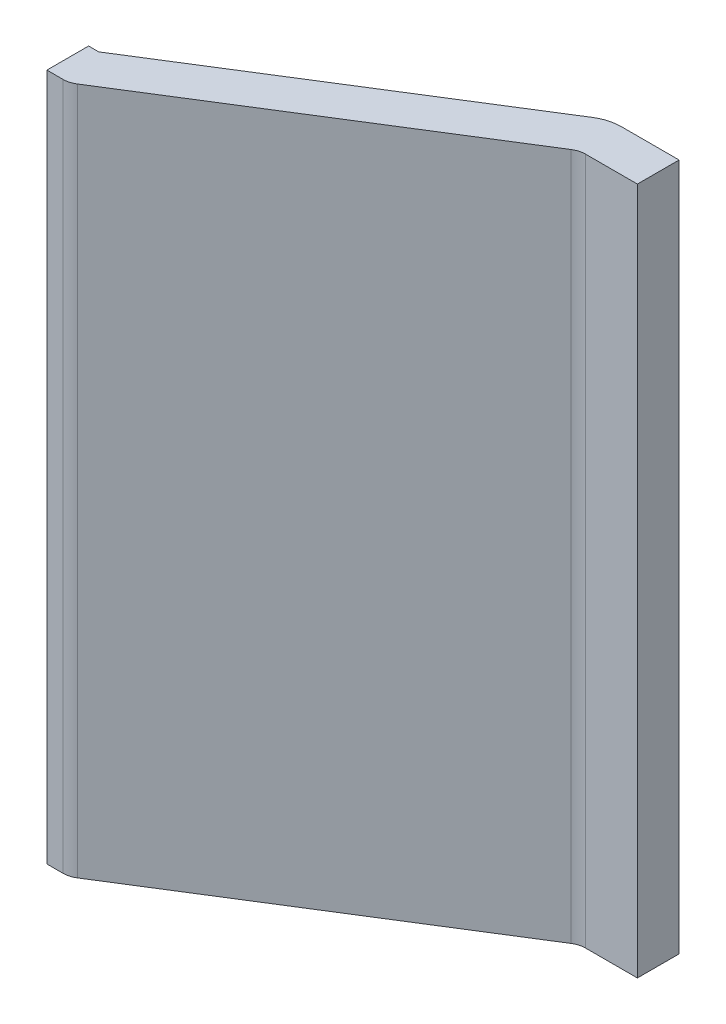
ISO-10303-21;
HEADER;
FILE_DESCRIPTION(('STEP AP214'),'2;1');
FILE_NAME('part.step','',(''),(''),'','','');
FILE_SCHEMA(('AUTOMOTIVE_DESIGN { 1 0 10303 214 1 1 1 1 }'));
ENDSEC;
DATA;
#1=APPLICATION_CONTEXT('core data for automotive mechanical design processes');
#2=APPLICATION_PROTOCOL_DEFINITION('international standard','automotive_design',2000,#1);
#3=PRODUCT_CONTEXT('',#1,'mechanical');
#4=PRODUCT('Part','Part','',(#3));
#5=PRODUCT_RELATED_PRODUCT_CATEGORY('part','',(#4));
#6=PRODUCT_DEFINITION_FORMATION('','',#4);
#7=PRODUCT_DEFINITION_CONTEXT('part definition',#1,'design');
#8=PRODUCT_DEFINITION('design','',#6,#7);
#9=PRODUCT_DEFINITION_SHAPE('','',#8);
#10=(LENGTH_UNIT() NAMED_UNIT(*) SI_UNIT(.MILLI.,.METRE.));
#11=(NAMED_UNIT(*) PLANE_ANGLE_UNIT() SI_UNIT($,.RADIAN.));
#12=(NAMED_UNIT(*) SI_UNIT($,.STERADIAN.) SOLID_ANGLE_UNIT());
#13=UNCERTAINTY_MEASURE_WITH_UNIT(LENGTH_MEASURE(1.E-05),#10,'distance_accuracy_value','');
#14=(GEOMETRIC_REPRESENTATION_CONTEXT(3) GLOBAL_UNCERTAINTY_ASSIGNED_CONTEXT((#13)) GLOBAL_UNIT_ASSIGNED_CONTEXT((#10,
#11,#12)) REPRESENTATION_CONTEXT('',''));
#15=CARTESIAN_POINT('',(0.,0.,0.));
#16=DIRECTION('',(0.,0.,1.));
#17=DIRECTION('',(1.,0.,0.));
#18=AXIS2_PLACEMENT_3D('',#15,#16,#17);
#19=CARTESIAN_POINT('',(1.824104576066,-1.525,0.964303036979));
#20=DIRECTION('',(0.,1.,0.));
#21=DIRECTION('',(0.530661276733133,0.,0.847583983671212));
#22=AXIS2_PLACEMENT_3D('',#19,#20,#21);
#23=CYLINDRICAL_SURFACE('',#22,0.0925);
#24=DIRECTION('',(0.,1.,0.));
#25=VECTOR('',#24,1.);
#26=CARTESIAN_POINT('',(1.873190744164,-1.525,1.042704555469));
#27=LINE('',#26,#25);
#28=CARTESIAN_POINT('',(1.873190744164,-1.525,1.042704555469));
#29=VERTEX_POINT('',#28);
#30=CARTESIAN_POINT('',(1.873190744164,1.525,1.042704555469));
#31=VERTEX_POINT('',#30);
#32=EDGE_CURVE('E26',#29,#31,#27,.T.);
#33=ORIENTED_EDGE('',*,*,#32,.T.);
#34=CARTESIAN_POINT('',(1.824104576066,1.525,0.964303036979));
#35=DIRECTION('',(0.,-1.,0.));
#36=DIRECTION('',(0.,0.,1.));
#37=AXIS2_PLACEMENT_3D('',#34,#35,#36);
#38=CIRCLE('',#37,0.0925);
#39=CARTESIAN_POINT('',(1.824104576066,1.525,1.056803036979));
#40=VERTEX_POINT('',#39);
#41=EDGE_CURVE('E193',#31,#40,#38,.T.);
#42=ORIENTED_EDGE('',*,*,#41,.T.);
#43=DIRECTION('',(0.,1.,0.));
#44=VECTOR('',#43,1.);
#45=CARTESIAN_POINT('',(1.824104576066,-1.525,1.056803036979));
#46=LINE('',#45,#44);
#47=CARTESIAN_POINT('',(1.824104576066,-1.525,1.056803036979));
#48=VERTEX_POINT('',#47);
#49=EDGE_CURVE('E11',#48,#40,#46,.T.);
#50=ORIENTED_EDGE('',*,*,#49,.F.);
#51=CARTESIAN_POINT('',(1.824104576066,-1.525,0.964303036979));
#52=DIRECTION('',(0.,-1.,0.));
#53=DIRECTION('',(0.,0.,1.));
#54=AXIS2_PLACEMENT_3D('',#51,#52,#53);
#55=CIRCLE('',#54,0.0925);
#56=EDGE_CURVE('E138',#29,#48,#55,.T.);
#57=ORIENTED_EDGE('',*,*,#56,.F.);
#58=EDGE_LOOP('',(#33,#42,#50,#57));
#59=FACE_BOUND('',#58,.T.);
#60=ADVANCED_FACE('F17',(#59),#23,.T.);
#61=CARTESIAN_POINT('',(1.7525,-1.525,1.056803036979));
#62=DIRECTION('',(0.,0.,1.));
#63=DIRECTION('',(1.,0.,0.));
#64=AXIS2_PLACEMENT_3D('',#61,#62,#63);
#65=PLANE('',#64);
#66=DIRECTION('',(1.,0.,0.));
#67=VECTOR('',#66,1.);
#68=CARTESIAN_POINT('',(1.7525,1.525,1.056803036979));
#69=LINE('',#68,#67);
#70=CARTESIAN_POINT('',(1.7525,1.525,1.056803036979));
#71=VERTEX_POINT('',#70);
#72=EDGE_CURVE('E189',#71,#40,#69,.T.);
#73=ORIENTED_EDGE('',*,*,#72,.F.);
#74=DIRECTION('',(0.,1.,0.));
#75=VECTOR('',#74,1.);
#76=CARTESIAN_POINT('',(1.7525,-1.525,1.056803036979));
#77=LINE('',#76,#75);
#78=CARTESIAN_POINT('',(1.7525,-1.525,1.056803036979));
#79=VERTEX_POINT('',#78);
#80=EDGE_CURVE('E215',#79,#71,#77,.T.);
#81=ORIENTED_EDGE('',*,*,#80,.F.);
#82=DIRECTION('',(1.,0.,0.));
#83=VECTOR('',#82,1.);
#84=CARTESIAN_POINT('',(1.7525,-1.525,1.056803036979));
#85=LINE('',#84,#83);
#86=EDGE_CURVE('E197',#79,#48,#85,.T.);
#87=ORIENTED_EDGE('',*,*,#86,.T.);
#88=ORIENTED_EDGE('',*,*,#49,.T.);
#89=EDGE_LOOP('',(#73,#81,#87,#88));
#90=FACE_BOUND('',#89,.T.);
#91=ADVANCED_FACE('F252',(#90),#65,.T.);
#92=CARTESIAN_POINT('',(3.288172336196,-1.525,0.156803036979));
#93=DIRECTION('',(0.530661276733133,0.,0.847583983671212));
#94=DIRECTION('',(0.,-1.,0.));
#95=AXIS2_PLACEMENT_3D('',#92,#93,#94);
#96=PLANE('',#95);
#97=DIRECTION('',(-0.847583983671212,0.,0.530661276733133));
#98=VECTOR('',#97,1.);
#99=CARTESIAN_POINT('',(3.288172336196,-1.525,0.156803036979));
#100=LINE('',#99,#98);
#101=CARTESIAN_POINT('',(3.220617112292,-1.525,0.19909848151));
#102=VERTEX_POINT('',#101);
#103=EDGE_CURVE('E128',#102,#29,#100,.T.);
#104=ORIENTED_EDGE('',*,*,#103,.F.);
#105=DIRECTION('',(0.,1.,0.));
#106=VECTOR('',#105,1.);
#107=CARTESIAN_POINT('',(3.220617112292,-1.525,0.19909848151));
#108=LINE('',#107,#106);
#109=CARTESIAN_POINT('',(3.220617112292,1.525,0.19909848151));
#110=VERTEX_POINT('',#109);
#111=EDGE_CURVE('E132',#102,#110,#108,.T.);
#112=ORIENTED_EDGE('',*,*,#111,.T.);
#113=DIRECTION('',(-0.847583983671212,0.,0.530661276733133));
#114=VECTOR('',#113,1.);
#115=CARTESIAN_POINT('',(3.288172336196,1.525,0.156803036979));
#116=LINE('',#115,#114);
#117=EDGE_CURVE('E205',#110,#31,#116,.T.);
#118=ORIENTED_EDGE('',*,*,#117,.T.);
#119=ORIENTED_EDGE('',*,*,#32,.F.);
#120=EDGE_LOOP('',(#104,#112,#118,#119));
#121=FACE_BOUND('',#120,.T.);
#122=ADVANCED_FACE('F19',(#121),#96,.T.);
#123=CARTESIAN_POINT('',(1.7525,-1.525,0.871803036979));
#124=DIRECTION('',(1.,0.,0.));
#125=DIRECTION('',(0.,1.,0.));
#126=AXIS2_PLACEMENT_3D('',#123,#124,#125);
#127=PLANE('',#126);
#128=DIRECTION('',(0.,0.,1.));
#129=VECTOR('',#128,1.);
#130=CARTESIAN_POINT('',(1.7525,-1.525,0.871803036979));
#131=LINE('',#130,#129);
#132=CARTESIAN_POINT('',(1.7525,-1.525,0.871803036979));
#133=VERTEX_POINT('',#132);
#134=EDGE_CURVE('E201',#133,#79,#131,.T.);
#135=ORIENTED_EDGE('',*,*,#134,.T.);
#136=ORIENTED_EDGE('',*,*,#80,.T.);
#137=DIRECTION('',(0.,0.,1.));
#138=VECTOR('',#137,1.);
#139=CARTESIAN_POINT('',(1.7525,1.525,0.871803036979));
#140=LINE('',#139,#138);
#141=CARTESIAN_POINT('',(1.7525,1.525,0.871803036979));
#142=VERTEX_POINT('',#141);
#143=EDGE_CURVE('E184',#142,#71,#140,.T.);
#144=ORIENTED_EDGE('',*,*,#143,.F.);
#145=DIRECTION('',(0.,1.,0.));
#146=VECTOR('',#145,1.);
#147=CARTESIAN_POINT('',(1.7525,-1.525,0.871803036979));
#148=LINE('',#147,#146);
#149=EDGE_CURVE('E239',#133,#142,#148,.T.);
#150=ORIENTED_EDGE('',*,*,#149,.F.);
#151=EDGE_LOOP('',(#135,#136,#144,#150));
#152=FACE_BOUND('',#151,.T.);
#153=ADVANCED_FACE('F247',(#152),#127,.F.);
#154=CARTESIAN_POINT('',(1.7525,-1.525,0.871803036979));
#155=DIRECTION('',(0.,0.,1.));
#156=DIRECTION('',(1.,0.,0.));
#157=AXIS2_PLACEMENT_3D('',#154,#155,#156);
#158=PLANE('',#157);
#159=DIRECTION('',(0.,1.,0.));
#160=VECTOR('',#159,1.);
#161=CARTESIAN_POINT('',(1.797536815936,-1.525,0.871803036979));
#162=LINE('',#161,#160);
#163=CARTESIAN_POINT('',(1.797536815936,-1.525,0.871803036979));
#164=VERTEX_POINT('',#163);
#165=CARTESIAN_POINT('',(1.797536815936,1.525,0.871803036979));
#166=VERTEX_POINT('',#165);
#167=EDGE_CURVE('E48',#164,#166,#162,.T.);
#168=ORIENTED_EDGE('',*,*,#167,.F.);
#169=DIRECTION('',(1.,0.,0.));
#170=VECTOR('',#169,1.);
#171=CARTESIAN_POINT('',(1.7525,-1.525,0.871803036979));
#172=LINE('',#171,#170);
#173=EDGE_CURVE('E222',#133,#164,#172,.T.);
#174=ORIENTED_EDGE('',*,*,#173,.F.);
#175=ORIENTED_EDGE('',*,*,#149,.T.);
#176=DIRECTION('',(1.,0.,0.));
#177=VECTOR('',#176,1.);
#178=CARTESIAN_POINT('',(1.7525,1.525,0.871803036979));
#179=LINE('',#178,#177);
#180=EDGE_CURVE('E181',#142,#166,#179,.T.);
#181=ORIENTED_EDGE('',*,*,#180,.T.);
#182=EDGE_LOOP('',(#168,#174,#175,#181));
#183=FACE_BOUND('',#182,.T.);
#184=ADVANCED_FACE('F258',(#183),#158,.F.);
#185=CARTESIAN_POINT('',(3.19,-1.525,0.));
#186=DIRECTION('',(0.530661276733133,0.,0.847583983671212));
#187=DIRECTION('',(0.,-1.,0.));
#188=AXIS2_PLACEMENT_3D('',#185,#186,#187);
#189=PLANE('',#188);
#190=ORIENTED_EDGE('',*,*,#167,.T.);
#191=DIRECTION('',(-0.847583983671212,0.,0.530661276733133));
#192=VECTOR('',#191,1.);
#193=CARTESIAN_POINT('',(3.19,1.525,0.));
#194=LINE('',#193,#192);
#195=CARTESIAN_POINT('',(3.144963184064,1.525,0.02819696302084));
#196=VERTEX_POINT('',#195);
#197=EDGE_CURVE('E185',#196,#166,#194,.T.);
#198=ORIENTED_EDGE('',*,*,#197,.F.);
#199=DIRECTION('',(0.,1.,0.));
#200=VECTOR('',#199,1.);
#201=CARTESIAN_POINT('',(3.144963184064,-1.525,0.02819696302084));
#202=LINE('',#201,#200);
#203=CARTESIAN_POINT('',(3.144963184064,-1.525,0.02819696302084));
#204=VERTEX_POINT('',#203);
#205=EDGE_CURVE('E38',#204,#196,#202,.T.);
#206=ORIENTED_EDGE('',*,*,#205,.F.);
#207=DIRECTION('',(-0.847583983671212,0.,0.530661276733133));
#208=VECTOR('',#207,1.);
#209=CARTESIAN_POINT('',(3.19,-1.525,0.));
#210=LINE('',#209,#208);
#211=EDGE_CURVE('E226',#204,#164,#210,.T.);
#212=ORIENTED_EDGE('',*,*,#211,.T.);
#213=EDGE_LOOP('',(#190,#198,#206,#212));
#214=FACE_BOUND('',#213,.T.);
#215=ADVANCED_FACE('F289',(#214),#189,.F.);
#216=CARTESIAN_POINT('',(3.24313552026,-1.525,0.185));
#217=DIRECTION('',(0.,1.,0.));
#218=DIRECTION('',(0.,0.,-1.));
#219=AXIS2_PLACEMENT_3D('',#216,#217,#218);
#220=CYLINDRICAL_SURFACE('',#219,0.185);
#221=CARTESIAN_POINT('',(3.24313552026,-1.525,0.185));
#222=DIRECTION('',(0.,1.,0.));
#223=DIRECTION('',(0.,0.,1.));
#224=AXIS2_PLACEMENT_3D('',#221,#222,#223);
#225=CIRCLE('',#224,0.185);
#226=CARTESIAN_POINT('',(3.24313552026,-1.525,0.));
#227=VERTEX_POINT('',#226);
#228=EDGE_CURVE('E229',#227,#204,#225,.T.);
#229=ORIENTED_EDGE('',*,*,#228,.T.);
#230=ORIENTED_EDGE('',*,*,#205,.T.);
#231=CARTESIAN_POINT('',(3.24313552026,1.525,0.185));
#232=DIRECTION('',(0.,1.,0.));
#233=DIRECTION('',(0.,0.,1.));
#234=AXIS2_PLACEMENT_3D('',#231,#232,#233);
#235=CIRCLE('',#234,0.185);
#236=CARTESIAN_POINT('',(3.24313552026,1.525,0.));
#237=VERTEX_POINT('',#236);
#238=EDGE_CURVE('E180',#237,#196,#235,.T.);
#239=ORIENTED_EDGE('',*,*,#238,.F.);
#240=DIRECTION('',(0.,1.,0.));
#241=VECTOR('',#240,1.);
#242=CARTESIAN_POINT('',(3.24313552026,-1.525,0.));
#243=LINE('',#242,#241);
#244=EDGE_CURVE('E232',#227,#237,#243,.T.);
#245=ORIENTED_EDGE('',*,*,#244,.F.);
#246=EDGE_LOOP('',(#229,#230,#239,#245));
#247=FACE_BOUND('',#246,.T.);
#248=ADVANCED_FACE('F288',(#247),#220,.T.);
#249=CARTESIAN_POINT('',(3.19,-1.525,0.));
#250=DIRECTION('',(0.,0.,1.));
#251=DIRECTION('',(1.,0.,0.));
#252=AXIS2_PLACEMENT_3D('',#249,#250,#251);
#253=PLANE('',#252);
#254=ORIENTED_EDGE('',*,*,#244,.T.);
#255=DIRECTION('',(1.,0.,0.));
#256=VECTOR('',#255,1.);
#257=CARTESIAN_POINT('',(3.19,1.525,0.));
#258=LINE('',#257,#256);
#259=CARTESIAN_POINT('',(3.5,1.525,0.));
#260=VERTEX_POINT('',#259);
#261=EDGE_CURVE('E175',#237,#260,#258,.T.);
#262=ORIENTED_EDGE('',*,*,#261,.T.);
#263=DIRECTION('',(0.,1.,0.));
#264=VECTOR('',#263,1.);
#265=CARTESIAN_POINT('',(3.5,-1.525,0.));
#266=LINE('',#265,#264);
#267=CARTESIAN_POINT('',(3.5,-1.525,0.));
#268=VERTEX_POINT('',#267);
#269=EDGE_CURVE('E172',#268,#260,#266,.T.);
#270=ORIENTED_EDGE('',*,*,#269,.F.);
#271=DIRECTION('',(1.,0.,0.));
#272=VECTOR('',#271,1.);
#273=CARTESIAN_POINT('',(3.19,-1.525,0.));
#274=LINE('',#273,#272);
#275=EDGE_CURVE('E139',#227,#268,#274,.T.);
#276=ORIENTED_EDGE('',*,*,#275,.F.);
#277=EDGE_LOOP('',(#254,#262,#270,#276));
#278=FACE_BOUND('',#277,.T.);
#279=ADVANCED_FACE('F283',(#278),#253,.F.);
#280=CARTESIAN_POINT('',(2.614100714426,-1.525,0.486101794686));
#281=DIRECTION('',(0.,-1.,0.));
#282=DIRECTION('',(0.,0.,-1.));
#283=AXIS2_PLACEMENT_3D('',#280,#281,#282);
#284=PLANE('',#283);
#285=ORIENTED_EDGE('',*,*,#275,.T.);
#286=DIRECTION('',(0.,0.,1.));
#287=VECTOR('',#286,1.);
#288=CARTESIAN_POINT('',(3.5,-1.525,0.));
#289=LINE('',#288,#287);
#290=CARTESIAN_POINT('',(3.5,-1.525,0.185));
#291=VERTEX_POINT('',#290);
#292=EDGE_CURVE('E150',#268,#291,#289,.T.);
#293=ORIENTED_EDGE('',*,*,#292,.T.);
#294=DIRECTION('',(1.,0.,0.));
#295=VECTOR('',#294,1.);
#296=CARTESIAN_POINT('',(3.19,-1.525,0.185));
#297=LINE('',#296,#295);
#298=CARTESIAN_POINT('',(3.269703280389,-1.525,0.185));
#299=VERTEX_POINT('',#298);
#300=EDGE_CURVE('E145',#299,#291,#297,.T.);
#301=ORIENTED_EDGE('',*,*,#300,.F.);
#302=CARTESIAN_POINT('',(3.269703280389,-1.525,0.2775));
#303=DIRECTION('',(0.,1.,0.));
#304=DIRECTION('',(0.,0.,1.));
#305=AXIS2_PLACEMENT_3D('',#302,#303,#304);
#306=CIRCLE('',#305,0.0925);
#307=EDGE_CURVE('E142',#299,#102,#306,.T.);
#308=ORIENTED_EDGE('',*,*,#307,.T.);
#309=ORIENTED_EDGE('',*,*,#103,.T.);
#310=ORIENTED_EDGE('',*,*,#56,.T.);
#311=ORIENTED_EDGE('',*,*,#86,.F.);
#312=ORIENTED_EDGE('',*,*,#134,.F.);
#313=ORIENTED_EDGE('',*,*,#173,.T.);
#314=ORIENTED_EDGE('',*,*,#211,.F.);
#315=ORIENTED_EDGE('',*,*,#228,.F.);
#316=EDGE_LOOP('',(#285,#293,#301,#308,#309,#310,#311,#312,#313,#314,#315));
#317=FACE_BOUND('',#316,.T.);
#318=ADVANCED_FACE('F143',(#317),#284,.T.);
#319=CARTESIAN_POINT('',(3.5,-1.525,0.));
#320=DIRECTION('',(1.,0.,0.));
#321=DIRECTION('',(0.,1.,0.));
#322=AXIS2_PLACEMENT_3D('',#319,#320,#321);
#323=PLANE('',#322);
#324=ORIENTED_EDGE('',*,*,#292,.F.);
#325=ORIENTED_EDGE('',*,*,#269,.T.);
#326=DIRECTION('',(0.,0.,1.));
#327=VECTOR('',#326,1.);
#328=CARTESIAN_POINT('',(3.5,1.525,0.));
#329=LINE('',#328,#327);
#330=CARTESIAN_POINT('',(3.5,1.525,0.185));
#331=VERTEX_POINT('',#330);
#332=EDGE_CURVE('E156',#260,#331,#329,.T.);
#333=ORIENTED_EDGE('',*,*,#332,.T.);
#334=DIRECTION('',(0.,1.,0.));
#335=VECTOR('',#334,1.);
#336=CARTESIAN_POINT('',(3.5,-1.525,0.185));
#337=LINE('',#336,#335);
#338=EDGE_CURVE('E169',#291,#331,#337,.T.);
#339=ORIENTED_EDGE('',*,*,#338,.F.);
#340=EDGE_LOOP('',(#324,#325,#333,#339));
#341=FACE_BOUND('',#340,.T.);
#342=ADVANCED_FACE('F280',(#341),#323,.T.);
#343=CARTESIAN_POINT('',(3.269703280389,-1.525,0.2775));
#344=DIRECTION('',(0.,1.,0.));
#345=DIRECTION('',(0.,0.,-1.));
#346=AXIS2_PLACEMENT_3D('',#343,#344,#345);
#347=CYLINDRICAL_SURFACE('',#346,0.0925);
#348=DIRECTION('',(0.,1.,0.));
#349=VECTOR('',#348,1.);
#350=CARTESIAN_POINT('',(3.269703280389,-1.525,0.185));
#351=LINE('',#350,#349);
#352=CARTESIAN_POINT('',(3.269703280389,1.525,0.185));
#353=VERTEX_POINT('',#352);
#354=EDGE_CURVE('E165',#299,#353,#351,.T.);
#355=ORIENTED_EDGE('',*,*,#354,.T.);
#356=CARTESIAN_POINT('',(3.269703280389,1.525,0.2775));
#357=DIRECTION('',(0.,1.,0.));
#358=DIRECTION('',(0.,0.,1.));
#359=AXIS2_PLACEMENT_3D('',#356,#357,#358);
#360=CIRCLE('',#359,0.0925);
#361=EDGE_CURVE('E153',#353,#110,#360,.T.);
#362=ORIENTED_EDGE('',*,*,#361,.T.);
#363=ORIENTED_EDGE('',*,*,#111,.F.);
#364=ORIENTED_EDGE('',*,*,#307,.F.);
#365=EDGE_LOOP('',(#355,#362,#363,#364));
#366=FACE_BOUND('',#365,.T.);
#367=ADVANCED_FACE('F152',(#366),#347,.F.);
#368=CARTESIAN_POINT('',(2.614100714426,1.525,0.486101794686));
#369=DIRECTION('',(0.,1.,0.));
#370=DIRECTION('',(0.,0.,-1.));
#371=AXIS2_PLACEMENT_3D('',#368,#369,#370);
#372=PLANE('',#371);
#373=ORIENTED_EDGE('',*,*,#261,.F.);
#374=ORIENTED_EDGE('',*,*,#238,.T.);
#375=ORIENTED_EDGE('',*,*,#197,.T.);
#376=ORIENTED_EDGE('',*,*,#180,.F.);
#377=ORIENTED_EDGE('',*,*,#143,.T.);
#378=ORIENTED_EDGE('',*,*,#72,.T.);
#379=ORIENTED_EDGE('',*,*,#41,.F.);
#380=ORIENTED_EDGE('',*,*,#117,.F.);
#381=ORIENTED_EDGE('',*,*,#361,.F.);
#382=DIRECTION('',(1.,0.,0.));
#383=VECTOR('',#382,1.);
#384=CARTESIAN_POINT('',(3.19,1.525,0.185));
#385=LINE('',#384,#383);
#386=EDGE_CURVE('E265',#353,#331,#385,.T.);
#387=ORIENTED_EDGE('',*,*,#386,.T.);
#388=ORIENTED_EDGE('',*,*,#332,.F.);
#389=EDGE_LOOP('',(#373,#374,#375,#376,#377,#378,#379,#380,#381,#387,#388));
#390=FACE_BOUND('',#389,.T.);
#391=ADVANCED_FACE('F257',(#390),#372,.T.);
#392=CARTESIAN_POINT('',(3.19,-1.525,0.185));
#393=DIRECTION('',(0.,0.,1.));
#394=DIRECTION('',(1.,0.,0.));
#395=AXIS2_PLACEMENT_3D('',#392,#393,#394);
#396=PLANE('',#395);
#397=ORIENTED_EDGE('',*,*,#386,.F.);
#398=ORIENTED_EDGE('',*,*,#354,.F.);
#399=ORIENTED_EDGE('',*,*,#300,.T.);
#400=ORIENTED_EDGE('',*,*,#338,.T.);
#401=EDGE_LOOP('',(#397,#398,#399,#400));
#402=FACE_BOUND('',#401,.T.);
#403=ADVANCED_FACE('F276',(#402),#396,.T.);
#404=CLOSED_SHELL('',(#60,#91,#122,#153,#184,#215,#248,#279,#318,#342,#367,#391,#403));
#405=MANIFOLD_SOLID_BREP('B1',#404);
#406=ADVANCED_BREP_SHAPE_REPRESENTATION('',(#18,#405),#14);
#407=SHAPE_DEFINITION_REPRESENTATION(#9,#406);
ENDSEC;
END-ISO-10303-21;
